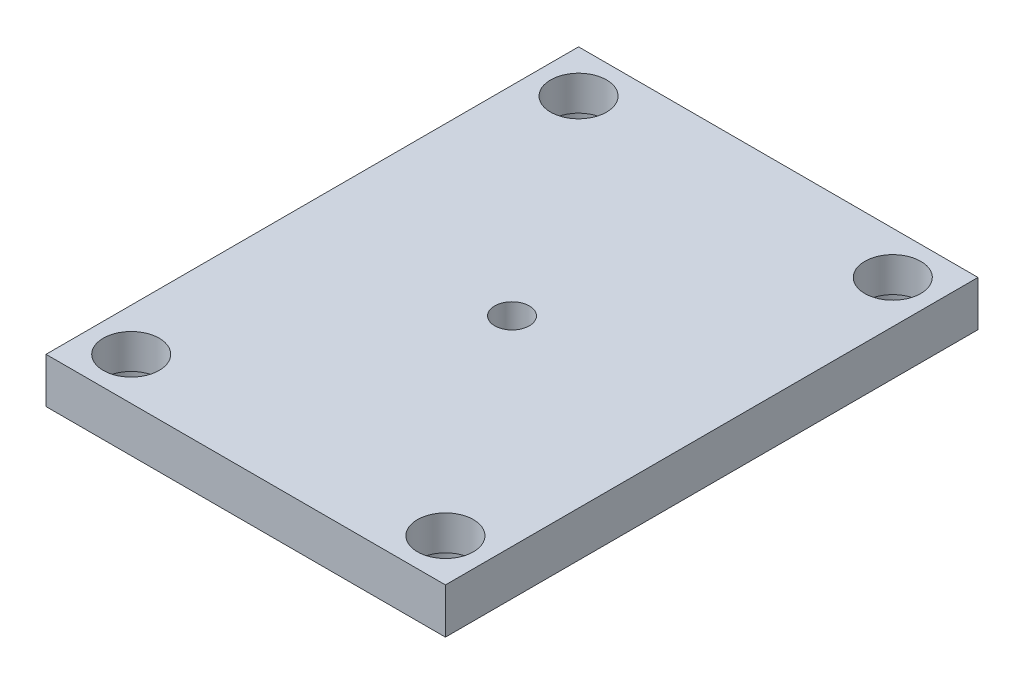
ISO-10303-21;
HEADER;
FILE_DESCRIPTION(('STEP AP214'),'2;1');
FILE_NAME('part.step','',(''),(''),'','','');
FILE_SCHEMA(('AUTOMOTIVE_DESIGN { 1 0 10303 214 1 1 1 1 }'));
ENDSEC;
DATA;
#1=APPLICATION_CONTEXT('core data for automotive mechanical design processes');
#2=APPLICATION_PROTOCOL_DEFINITION('international standard','automotive_design',2000,#1);
#3=PRODUCT_CONTEXT('',#1,'mechanical');
#4=PRODUCT('Part','Part','',(#3));
#5=PRODUCT_RELATED_PRODUCT_CATEGORY('part','',(#4));
#6=PRODUCT_DEFINITION_FORMATION('','',#4);
#7=PRODUCT_DEFINITION_CONTEXT('part definition',#1,'design');
#8=PRODUCT_DEFINITION('design','',#6,#7);
#9=PRODUCT_DEFINITION_SHAPE('','',#8);
#10=(LENGTH_UNIT() NAMED_UNIT(*) SI_UNIT(.MILLI.,.METRE.));
#11=(NAMED_UNIT(*) PLANE_ANGLE_UNIT() SI_UNIT($,.RADIAN.));
#12=(NAMED_UNIT(*) SI_UNIT($,.STERADIAN.) SOLID_ANGLE_UNIT());
#13=UNCERTAINTY_MEASURE_WITH_UNIT(LENGTH_MEASURE(1.E-05),#10,'distance_accuracy_value','');
#14=(GEOMETRIC_REPRESENTATION_CONTEXT(3) GLOBAL_UNCERTAINTY_ASSIGNED_CONTEXT((#13)) GLOBAL_UNIT_ASSIGNED_CONTEXT((#10,
#11,#12)) REPRESENTATION_CONTEXT('',''));
#15=CARTESIAN_POINT('',(0.,0.,0.));
#16=DIRECTION('',(0.,0.,1.));
#17=DIRECTION('',(1.,0.,0.));
#18=AXIS2_PLACEMENT_3D('',#15,#16,#17);
#19=CARTESIAN_POINT('',(-150.,34.,200.));
#20=DIRECTION('',(0.,1.,0.));
#21=DIRECTION('',(0.,0.,1.));
#22=AXIS2_PLACEMENT_3D('',#19,#20,#21);
#23=PLANE('',#22);
#24=CARTESIAN_POINT('',(118.,34.,168.));
#25=DIRECTION('',(0.,-1.,0.));
#26=DIRECTION('',(0.,0.,-1.));
#27=AXIS2_PLACEMENT_3D('',#24,#25,#26);
#28=CIRCLE('',#27,21.);
#29=CARTESIAN_POINT('',(118.,34.,147.));
#30=VERTEX_POINT('',#29);
#31=EDGE_CURVE('E272',#30,#30,#28,.T.);
#32=ORIENTED_EDGE('',*,*,#31,.T.);
#33=EDGE_LOOP('',(#32));
#34=FACE_BOUND('',#33,.T.);
#35=CARTESIAN_POINT('',(118.,34.,-168.));
#36=DIRECTION('',(0.,-1.,0.));
#37=DIRECTION('',(0.,0.,-1.));
#38=AXIS2_PLACEMENT_3D('',#35,#36,#37);
#39=CIRCLE('',#38,21.);
#40=CARTESIAN_POINT('',(118.,34.,-189.));
#41=VERTEX_POINT('',#40);
#42=EDGE_CURVE('E283',#41,#41,#39,.T.);
#43=ORIENTED_EDGE('',*,*,#42,.T.);
#44=EDGE_LOOP('',(#43));
#45=FACE_BOUND('',#44,.T.);
#46=CARTESIAN_POINT('',(-118.,34.,-168.));
#47=DIRECTION('',(0.,-1.,0.));
#48=DIRECTION('',(0.,0.,-1.));
#49=AXIS2_PLACEMENT_3D('',#46,#47,#48);
#50=CIRCLE('',#49,21.);
#51=CARTESIAN_POINT('',(-118.,34.,-189.));
#52=VERTEX_POINT('',#51);
#53=EDGE_CURVE('E295',#52,#52,#50,.T.);
#54=ORIENTED_EDGE('',*,*,#53,.T.);
#55=EDGE_LOOP('',(#54));
#56=FACE_BOUND('',#55,.T.);
#57=CARTESIAN_POINT('',(-118.,34.,168.));
#58=DIRECTION('',(0.,-1.,0.));
#59=DIRECTION('',(0.,0.,-1.));
#60=AXIS2_PLACEMENT_3D('',#57,#58,#59);
#61=CIRCLE('',#60,21.);
#62=CARTESIAN_POINT('',(-118.,34.,147.));
#63=VERTEX_POINT('',#62);
#64=EDGE_CURVE('E104',#63,#63,#61,.T.);
#65=ORIENTED_EDGE('',*,*,#64,.T.);
#66=EDGE_LOOP('',(#65));
#67=FACE_BOUND('',#66,.T.);
#68=DIRECTION('',(0.,0.,1.));
#69=VECTOR('',#68,1.);
#70=CARTESIAN_POINT('',(-150.,34.,-200.));
#71=LINE('',#70,#69);
#72=CARTESIAN_POINT('',(-150.,34.,-200.));
#73=VERTEX_POINT('',#72);
#74=CARTESIAN_POINT('',(-150.,34.,200.));
#75=VERTEX_POINT('',#74);
#76=EDGE_CURVE('E138',#73,#75,#71,.T.);
#77=ORIENTED_EDGE('',*,*,#76,.T.);
#78=DIRECTION('',(1.,0.,0.));
#79=VECTOR('',#78,1.);
#80=CARTESIAN_POINT('',(-150.,34.,200.));
#81=LINE('',#80,#79);
#82=CARTESIAN_POINT('',(150.,34.,200.));
#83=VERTEX_POINT('',#82);
#84=EDGE_CURVE('E80',#75,#83,#81,.T.);
#85=ORIENTED_EDGE('',*,*,#84,.T.);
#86=DIRECTION('',(0.,0.,-1.));
#87=VECTOR('',#86,1.);
#88=CARTESIAN_POINT('',(150.,34.,-200.));
#89=LINE('',#88,#87);
#90=CARTESIAN_POINT('',(150.,34.,-200.));
#91=VERTEX_POINT('',#90);
#92=EDGE_CURVE('E141',#83,#91,#89,.T.);
#93=ORIENTED_EDGE('',*,*,#92,.T.);
#94=DIRECTION('',(-1.,0.,0.));
#95=VECTOR('',#94,1.);
#96=CARTESIAN_POINT('',(-150.,34.,-200.));
#97=LINE('',#96,#95);
#98=EDGE_CURVE('E49',#91,#73,#97,.T.);
#99=ORIENTED_EDGE('',*,*,#98,.T.);
#100=EDGE_LOOP('',(#77,#85,#93,#99));
#101=FACE_BOUND('',#100,.T.);
#102=CARTESIAN_POINT('',(0.,34.,0.));
#103=DIRECTION('',(0.,1.,0.));
#104=DIRECTION('',(0.,0.,1.));
#105=AXIS2_PLACEMENT_3D('',#102,#103,#104);
#106=CIRCLE('',#105,13.);
#107=CARTESIAN_POINT('',(0.,34.,13.));
#108=VERTEX_POINT('',#107);
#109=EDGE_CURVE('E132',#108,#108,#106,.T.);
#110=ORIENTED_EDGE('',*,*,#109,.F.);
#111=EDGE_LOOP('',(#110));
#112=FACE_BOUND('',#111,.T.);
#113=ADVANCED_FACE('F32',(#34,#45,#56,#67,#101,#112),#23,.T.);
#114=CARTESIAN_POINT('',(-150.,0.,200.));
#115=DIRECTION('',(0.,1.,0.));
#116=DIRECTION('',(0.,0.,1.));
#117=AXIS2_PLACEMENT_3D('',#114,#115,#116);
#118=PLANE('',#117);
#119=CARTESIAN_POINT('',(118.,0.,168.));
#120=DIRECTION('',(0.,-1.,0.));
#121=DIRECTION('',(0.,0.,-1.));
#122=AXIS2_PLACEMENT_3D('',#119,#120,#121);
#123=CIRCLE('',#122,24.);
#124=CARTESIAN_POINT('',(118.,0.,144.));
#125=VERTEX_POINT('',#124);
#126=EDGE_CURVE('E265',#125,#125,#123,.T.);
#127=ORIENTED_EDGE('',*,*,#126,.F.);
#128=EDGE_LOOP('',(#127));
#129=FACE_BOUND('',#128,.T.);
#130=CARTESIAN_POINT('',(118.,0.,-168.));
#131=DIRECTION('',(0.,-1.,0.));
#132=DIRECTION('',(0.,0.,-1.));
#133=AXIS2_PLACEMENT_3D('',#130,#131,#132);
#134=CIRCLE('',#133,24.);
#135=CARTESIAN_POINT('',(118.,0.,-192.));
#136=VERTEX_POINT('',#135);
#137=EDGE_CURVE('E274',#136,#136,#134,.T.);
#138=ORIENTED_EDGE('',*,*,#137,.F.);
#139=EDGE_LOOP('',(#138));
#140=FACE_BOUND('',#139,.T.);
#141=CARTESIAN_POINT('',(-118.,0.,-168.));
#142=DIRECTION('',(0.,-1.,0.));
#143=DIRECTION('',(0.,0.,-1.));
#144=AXIS2_PLACEMENT_3D('',#141,#142,#143);
#145=CIRCLE('',#144,24.);
#146=CARTESIAN_POINT('',(-118.,0.,-192.));
#147=VERTEX_POINT('',#146);
#148=EDGE_CURVE('E286',#147,#147,#145,.T.);
#149=ORIENTED_EDGE('',*,*,#148,.F.);
#150=EDGE_LOOP('',(#149));
#151=FACE_BOUND('',#150,.T.);
#152=CARTESIAN_POINT('',(-118.,0.,168.));
#153=DIRECTION('',(0.,-1.,0.));
#154=DIRECTION('',(0.,0.,-1.));
#155=AXIS2_PLACEMENT_3D('',#152,#153,#154);
#156=CIRCLE('',#155,24.);
#157=CARTESIAN_POINT('',(-118.,0.,144.));
#158=VERTEX_POINT('',#157);
#159=EDGE_CURVE('E298',#158,#158,#156,.T.);
#160=ORIENTED_EDGE('',*,*,#159,.F.);
#161=EDGE_LOOP('',(#160));
#162=FACE_BOUND('',#161,.T.);
#163=CARTESIAN_POINT('',(-118.,0.,119.));
#164=DIRECTION('',(0.,-1.,0.));
#165=DIRECTION('',(0.,0.,-1.));
#166=AXIS2_PLACEMENT_3D('',#163,#164,#165);
#167=CIRCLE('',#166,6.99999999999999);
#168=CARTESIAN_POINT('',(-118.,0.,112.));
#169=VERTEX_POINT('',#168);
#170=EDGE_CURVE('E103',#169,#169,#167,.T.);
#171=ORIENTED_EDGE('',*,*,#170,.F.);
#172=EDGE_LOOP('',(#171));
#173=FACE_BOUND('',#172,.T.);
#174=CARTESIAN_POINT('',(118.,0.,119.));
#175=DIRECTION('',(0.,-1.,0.));
#176=DIRECTION('',(0.,0.,-1.));
#177=AXIS2_PLACEMENT_3D('',#174,#175,#176);
#178=CIRCLE('',#177,6.99999999999999);
#179=CARTESIAN_POINT('',(118.,0.,112.));
#180=VERTEX_POINT('',#179);
#181=EDGE_CURVE('E116',#180,#180,#178,.T.);
#182=ORIENTED_EDGE('',*,*,#181,.F.);
#183=EDGE_LOOP('',(#182));
#184=FACE_BOUND('',#183,.T.);
#185=CARTESIAN_POINT('',(-118.,0.,-119.));
#186=DIRECTION('',(0.,-1.,0.));
#187=DIRECTION('',(0.,0.,-1.));
#188=AXIS2_PLACEMENT_3D('',#185,#186,#187);
#189=CIRCLE('',#188,6.99999999999999);
#190=CARTESIAN_POINT('',(-118.,0.,-126.));
#191=VERTEX_POINT('',#190);
#192=EDGE_CURVE('E122',#191,#191,#189,.T.);
#193=ORIENTED_EDGE('',*,*,#192,.F.);
#194=EDGE_LOOP('',(#193));
#195=FACE_BOUND('',#194,.T.);
#196=CARTESIAN_POINT('',(118.,0.,-119.));
#197=DIRECTION('',(0.,-1.,0.));
#198=DIRECTION('',(0.,0.,-1.));
#199=AXIS2_PLACEMENT_3D('',#196,#197,#198);
#200=CIRCLE('',#199,6.99999999999999);
#201=CARTESIAN_POINT('',(118.,0.,-126.));
#202=VERTEX_POINT('',#201);
#203=EDGE_CURVE('E128',#202,#202,#200,.T.);
#204=ORIENTED_EDGE('',*,*,#203,.F.);
#205=EDGE_LOOP('',(#204));
#206=FACE_BOUND('',#205,.T.);
#207=DIRECTION('',(0.,0.,1.));
#208=VECTOR('',#207,1.);
#209=CARTESIAN_POINT('',(-150.,0.,-200.));
#210=LINE('',#209,#208);
#211=CARTESIAN_POINT('',(-150.,0.,-200.));
#212=VERTEX_POINT('',#211);
#213=CARTESIAN_POINT('',(-150.,0.,200.));
#214=VERTEX_POINT('',#213);
#215=EDGE_CURVE('E135',#212,#214,#210,.T.);
#216=ORIENTED_EDGE('',*,*,#215,.F.);
#217=DIRECTION('',(-1.,0.,0.));
#218=VECTOR('',#217,1.);
#219=CARTESIAN_POINT('',(-150.,0.,-200.));
#220=LINE('',#219,#218);
#221=CARTESIAN_POINT('',(150.,0.,-200.));
#222=VERTEX_POINT('',#221);
#223=EDGE_CURVE('E73',#222,#212,#220,.T.);
#224=ORIENTED_EDGE('',*,*,#223,.F.);
#225=DIRECTION('',(0.,0.,-1.));
#226=VECTOR('',#225,1.);
#227=CARTESIAN_POINT('',(150.,0.,-200.));
#228=LINE('',#227,#226);
#229=CARTESIAN_POINT('',(150.,0.,200.));
#230=VERTEX_POINT('',#229);
#231=EDGE_CURVE('E67',#230,#222,#228,.T.);
#232=ORIENTED_EDGE('',*,*,#231,.F.);
#233=DIRECTION('',(1.,0.,0.));
#234=VECTOR('',#233,1.);
#235=CARTESIAN_POINT('',(-150.,0.,200.));
#236=LINE('',#235,#234);
#237=EDGE_CURVE('E147',#214,#230,#236,.T.);
#238=ORIENTED_EDGE('',*,*,#237,.F.);
#239=EDGE_LOOP('',(#216,#224,#232,#238));
#240=FACE_BOUND('',#239,.T.);
#241=CARTESIAN_POINT('',(0.,0.,0.));
#242=DIRECTION('',(0.,1.,0.));
#243=DIRECTION('',(0.,0.,1.));
#244=AXIS2_PLACEMENT_3D('',#241,#242,#243);
#245=CIRCLE('',#244,13.);
#246=CARTESIAN_POINT('',(0.,0.,13.));
#247=VERTEX_POINT('',#246);
#248=EDGE_CURVE('E131',#247,#247,#245,.T.);
#249=ORIENTED_EDGE('',*,*,#248,.T.);
#250=EDGE_LOOP('',(#249));
#251=FACE_BOUND('',#250,.T.);
#252=ADVANCED_FACE('F157',(#129,#140,#151,#162,#173,#184,#195,#206,#240,#251),#118,.F.);
#253=CARTESIAN_POINT('',(-150.,34.,-200.));
#254=DIRECTION('',(1.,0.,0.));
#255=DIRECTION('',(0.,0.,-1.));
#256=AXIS2_PLACEMENT_3D('',#253,#254,#255);
#257=PLANE('',#256);
#258=ORIENTED_EDGE('',*,*,#215,.T.);
#259=DIRECTION('',(0.,-1.,0.));
#260=VECTOR('',#259,1.);
#261=CARTESIAN_POINT('',(-150.,34.,200.));
#262=LINE('',#261,#260);
#263=EDGE_CURVE('E11',#75,#214,#262,.T.);
#264=ORIENTED_EDGE('',*,*,#263,.F.);
#265=ORIENTED_EDGE('',*,*,#76,.F.);
#266=DIRECTION('',(0.,-1.,0.));
#267=VECTOR('',#266,1.);
#268=CARTESIAN_POINT('',(-150.,34.,-200.));
#269=LINE('',#268,#267);
#270=EDGE_CURVE('E144',#73,#212,#269,.T.);
#271=ORIENTED_EDGE('',*,*,#270,.T.);
#272=EDGE_LOOP('',(#258,#264,#265,#271));
#273=FACE_BOUND('',#272,.T.);
#274=ADVANCED_FACE('F34',(#273),#257,.F.);
#275=CARTESIAN_POINT('',(-150.,34.,200.));
#276=DIRECTION('',(0.,0.,-1.));
#277=DIRECTION('',(-1.,0.,0.));
#278=AXIS2_PLACEMENT_3D('',#275,#276,#277);
#279=PLANE('',#278);
#280=ORIENTED_EDGE('',*,*,#237,.T.);
#281=DIRECTION('',(0.,-1.,0.));
#282=VECTOR('',#281,1.);
#283=CARTESIAN_POINT('',(150.,34.,200.));
#284=LINE('',#283,#282);
#285=EDGE_CURVE('E41',#83,#230,#284,.T.);
#286=ORIENTED_EDGE('',*,*,#285,.F.);
#287=ORIENTED_EDGE('',*,*,#84,.F.);
#288=ORIENTED_EDGE('',*,*,#263,.T.);
#289=EDGE_LOOP('',(#280,#286,#287,#288));
#290=FACE_BOUND('',#289,.T.);
#291=ADVANCED_FACE('F173',(#290),#279,.F.);
#292=CARTESIAN_POINT('',(150.,34.,-200.));
#293=DIRECTION('',(-1.,0.,0.));
#294=DIRECTION('',(0.,0.,1.));
#295=AXIS2_PLACEMENT_3D('',#292,#293,#294);
#296=PLANE('',#295);
#297=ORIENTED_EDGE('',*,*,#231,.T.);
#298=DIRECTION('',(0.,-1.,0.));
#299=VECTOR('',#298,1.);
#300=CARTESIAN_POINT('',(150.,34.,-200.));
#301=LINE('',#300,#299);
#302=EDGE_CURVE('E152',#91,#222,#301,.T.);
#303=ORIENTED_EDGE('',*,*,#302,.F.);
#304=ORIENTED_EDGE('',*,*,#92,.F.);
#305=ORIENTED_EDGE('',*,*,#285,.T.);
#306=EDGE_LOOP('',(#297,#303,#304,#305));
#307=FACE_BOUND('',#306,.T.);
#308=ADVANCED_FACE('F154',(#307),#296,.F.);
#309=CARTESIAN_POINT('',(-150.,34.,-200.));
#310=DIRECTION('',(0.,0.,1.));
#311=DIRECTION('',(1.,0.,0.));
#312=AXIS2_PLACEMENT_3D('',#309,#310,#311);
#313=PLANE('',#312);
#314=ORIENTED_EDGE('',*,*,#223,.T.);
#315=ORIENTED_EDGE('',*,*,#270,.F.);
#316=ORIENTED_EDGE('',*,*,#98,.F.);
#317=ORIENTED_EDGE('',*,*,#302,.T.);
#318=EDGE_LOOP('',(#314,#315,#316,#317));
#319=FACE_BOUND('',#318,.T.);
#320=ADVANCED_FACE('F162',(#319),#313,.F.);
#321=CARTESIAN_POINT('',(0.,34.,0.));
#322=DIRECTION('',(0.,-1.,0.));
#323=DIRECTION('',(0.,0.,-1.));
#324=AXIS2_PLACEMENT_3D('',#321,#322,#323);
#325=CYLINDRICAL_SURFACE('',#324,13.);
#326=ORIENTED_EDGE('',*,*,#109,.T.);
#327=EDGE_LOOP('',(#326));
#328=FACE_BOUND('',#327,.T.);
#329=ORIENTED_EDGE('',*,*,#248,.F.);
#330=EDGE_LOOP('',(#329));
#331=FACE_BOUND('',#330,.T.);
#332=ADVANCED_FACE('F164',(#328,#331),#325,.F.);
#333=CARTESIAN_POINT('',(118.,0.,-119.));
#334=DIRECTION('',(0.,-1.,0.));
#335=DIRECTION('',(0.,0.,-1.));
#336=AXIS2_PLACEMENT_3D('',#333,#334,#335);
#337=CYLINDRICAL_SURFACE('',#336,6.99999999999999);
#338=CARTESIAN_POINT('',(118.,28.,-119.));
#339=DIRECTION('',(0.,-1.,0.));
#340=DIRECTION('',(0.,0.,-1.));
#341=AXIS2_PLACEMENT_3D('',#338,#339,#340);
#342=CIRCLE('',#341,6.99999999999999);
#343=CARTESIAN_POINT('',(118.,28.,-126.));
#344=VERTEX_POINT('',#343);
#345=EDGE_CURVE('E125',#344,#344,#342,.T.);
#346=ORIENTED_EDGE('',*,*,#345,.F.);
#347=EDGE_LOOP('',(#346));
#348=FACE_BOUND('',#347,.T.);
#349=ORIENTED_EDGE('',*,*,#203,.T.);
#350=EDGE_LOOP('',(#349));
#351=FACE_BOUND('',#350,.T.);
#352=ADVANCED_FACE('F170',(#348,#351),#337,.F.);
#353=CARTESIAN_POINT('',(118.,28.,-119.));
#354=DIRECTION('',(0.,-1.,0.));
#355=DIRECTION('',(0.,0.,-1.));
#356=AXIS2_PLACEMENT_3D('',#353,#354,#355);
#357=CONICAL_SURFACE('',#356,6.99999999999999,1.02974425867665);
#358=CARTESIAN_POINT('',(118.,32.2060243331929,-119.));
#359=VERTEX_POINT('',#358);
#360=VERTEX_LOOP('',#359);
#361=FACE_BOUND('',#360,.T.);
#362=ORIENTED_EDGE('',*,*,#345,.T.);
#363=EDGE_LOOP('',(#362));
#364=FACE_BOUND('',#363,.T.);
#365=ADVANCED_FACE('F188',(#361,#364),#357,.F.);
#366=CARTESIAN_POINT('',(-118.,0.,-119.));
#367=DIRECTION('',(0.,-1.,0.));
#368=DIRECTION('',(0.,0.,-1.));
#369=AXIS2_PLACEMENT_3D('',#366,#367,#368);
#370=CYLINDRICAL_SURFACE('',#369,6.99999999999999);
#371=CARTESIAN_POINT('',(-118.,28.,-119.));
#372=DIRECTION('',(0.,-1.,0.));
#373=DIRECTION('',(0.,0.,-1.));
#374=AXIS2_PLACEMENT_3D('',#371,#372,#373);
#375=CIRCLE('',#374,6.99999999999999);
#376=CARTESIAN_POINT('',(-118.,28.,-126.));
#377=VERTEX_POINT('',#376);
#378=EDGE_CURVE('E119',#377,#377,#375,.T.);
#379=ORIENTED_EDGE('',*,*,#378,.F.);
#380=EDGE_LOOP('',(#379));
#381=FACE_BOUND('',#380,.T.);
#382=ORIENTED_EDGE('',*,*,#192,.T.);
#383=EDGE_LOOP('',(#382));
#384=FACE_BOUND('',#383,.T.);
#385=ADVANCED_FACE('F192',(#381,#384),#370,.F.);
#386=CARTESIAN_POINT('',(-118.,28.,-119.));
#387=DIRECTION('',(0.,-1.,0.));
#388=DIRECTION('',(0.,0.,-1.));
#389=AXIS2_PLACEMENT_3D('',#386,#387,#388);
#390=CONICAL_SURFACE('',#389,6.99999999999999,1.02974425867665);
#391=CARTESIAN_POINT('',(-118.,32.2060243331929,-119.));
#392=VERTEX_POINT('',#391);
#393=VERTEX_LOOP('',#392);
#394=FACE_BOUND('',#393,.T.);
#395=ORIENTED_EDGE('',*,*,#378,.T.);
#396=EDGE_LOOP('',(#395));
#397=FACE_BOUND('',#396,.T.);
#398=ADVANCED_FACE('F196',(#394,#397),#390,.F.);
#399=CARTESIAN_POINT('',(118.,0.,119.));
#400=DIRECTION('',(0.,-1.,0.));
#401=DIRECTION('',(0.,0.,-1.));
#402=AXIS2_PLACEMENT_3D('',#399,#400,#401);
#403=CYLINDRICAL_SURFACE('',#402,6.99999999999999);
#404=CARTESIAN_POINT('',(118.,28.,119.));
#405=DIRECTION('',(0.,-1.,0.));
#406=DIRECTION('',(0.,0.,-1.));
#407=AXIS2_PLACEMENT_3D('',#404,#405,#406);
#408=CIRCLE('',#407,6.99999999999999);
#409=CARTESIAN_POINT('',(118.,28.,112.));
#410=VERTEX_POINT('',#409);
#411=EDGE_CURVE('E107',#410,#410,#408,.T.);
#412=ORIENTED_EDGE('',*,*,#411,.F.);
#413=EDGE_LOOP('',(#412));
#414=FACE_BOUND('',#413,.T.);
#415=ORIENTED_EDGE('',*,*,#181,.T.);
#416=EDGE_LOOP('',(#415));
#417=FACE_BOUND('',#416,.T.);
#418=ADVANCED_FACE('F200',(#414,#417),#403,.F.);
#419=CARTESIAN_POINT('',(118.,28.,119.));
#420=DIRECTION('',(0.,-1.,0.));
#421=DIRECTION('',(0.,0.,-1.));
#422=AXIS2_PLACEMENT_3D('',#419,#420,#421);
#423=CONICAL_SURFACE('',#422,6.99999999999999,1.02974425867665);
#424=CARTESIAN_POINT('',(118.,32.2060243331929,119.));
#425=VERTEX_POINT('',#424);
#426=VERTEX_LOOP('',#425);
#427=FACE_BOUND('',#426,.T.);
#428=ORIENTED_EDGE('',*,*,#411,.T.);
#429=EDGE_LOOP('',(#428));
#430=FACE_BOUND('',#429,.T.);
#431=ADVANCED_FACE('F204',(#427,#430),#423,.F.);
#432=CARTESIAN_POINT('',(-118.,0.,119.));
#433=DIRECTION('',(0.,-1.,0.));
#434=DIRECTION('',(0.,0.,-1.));
#435=AXIS2_PLACEMENT_3D('',#432,#433,#434);
#436=CYLINDRICAL_SURFACE('',#435,6.99999999999999);
#437=CARTESIAN_POINT('',(-118.,28.,119.));
#438=DIRECTION('',(0.,-1.,0.));
#439=DIRECTION('',(0.,0.,-1.));
#440=AXIS2_PLACEMENT_3D('',#437,#438,#439);
#441=CIRCLE('',#440,6.99999999999999);
#442=CARTESIAN_POINT('',(-118.,28.,112.));
#443=VERTEX_POINT('',#442);
#444=EDGE_CURVE('E101',#443,#443,#441,.T.);
#445=ORIENTED_EDGE('',*,*,#444,.F.);
#446=EDGE_LOOP('',(#445));
#447=FACE_BOUND('',#446,.T.);
#448=ORIENTED_EDGE('',*,*,#170,.T.);
#449=EDGE_LOOP('',(#448));
#450=FACE_BOUND('',#449,.T.);
#451=ADVANCED_FACE('F97',(#447,#450),#436,.F.);
#452=CARTESIAN_POINT('',(-118.,28.,119.));
#453=DIRECTION('',(0.,-1.,0.));
#454=DIRECTION('',(0.,0.,-1.));
#455=AXIS2_PLACEMENT_3D('',#452,#453,#454);
#456=CONICAL_SURFACE('',#455,6.99999999999999,1.02974425867665);
#457=CARTESIAN_POINT('',(-118.,32.2060243331929,119.));
#458=VERTEX_POINT('',#457);
#459=VERTEX_LOOP('',#458);
#460=FACE_BOUND('',#459,.T.);
#461=ORIENTED_EDGE('',*,*,#444,.T.);
#462=EDGE_LOOP('',(#461));
#463=FACE_BOUND('',#462,.T.);
#464=ADVANCED_FACE('F93',(#460,#463),#456,.F.);
#465=CARTESIAN_POINT('',(-118.,0.,168.));
#466=DIRECTION('',(0.,-1.,0.));
#467=DIRECTION('',(0.,0.,-1.));
#468=AXIS2_PLACEMENT_3D('',#465,#466,#467);
#469=CYLINDRICAL_SURFACE('',#468,21.);
#470=ORIENTED_EDGE('',*,*,#64,.F.);
#471=EDGE_LOOP('',(#470));
#472=FACE_BOUND('',#471,.T.);
#473=CARTESIAN_POINT('',(-118.,8.,168.));
#474=DIRECTION('',(0.,-1.,0.));
#475=DIRECTION('',(0.,0.,-1.));
#476=AXIS2_PLACEMENT_3D('',#473,#474,#475);
#477=CIRCLE('',#476,21.);
#478=CARTESIAN_POINT('',(-118.,8.,147.));
#479=VERTEX_POINT('',#478);
#480=EDGE_CURVE('E110',#479,#479,#477,.T.);
#481=ORIENTED_EDGE('',*,*,#480,.T.);
#482=EDGE_LOOP('',(#481));
#483=FACE_BOUND('',#482,.T.);
#484=ADVANCED_FACE('F96',(#472,#483),#469,.F.);
#485=CARTESIAN_POINT('',(-97.,8.,168.));
#486=DIRECTION('',(0.,1.,0.));
#487=DIRECTION('',(0.,0.,1.));
#488=AXIS2_PLACEMENT_3D('',#485,#486,#487);
#489=PLANE('',#488);
#490=ORIENTED_EDGE('',*,*,#480,.F.);
#491=EDGE_LOOP('',(#490));
#492=FACE_BOUND('',#491,.T.);
#493=CARTESIAN_POINT('',(-118.,8.,168.));
#494=DIRECTION('',(0.,-1.,0.));
#495=DIRECTION('',(0.,0.,-1.));
#496=AXIS2_PLACEMENT_3D('',#493,#494,#495);
#497=CIRCLE('',#496,24.);
#498=CARTESIAN_POINT('',(-118.,8.,144.));
#499=VERTEX_POINT('',#498);
#500=EDGE_CURVE('E301',#499,#499,#497,.T.);
#501=ORIENTED_EDGE('',*,*,#500,.T.);
#502=EDGE_LOOP('',(#501));
#503=FACE_BOUND('',#502,.T.);
#504=ADVANCED_FACE('F213',(#492,#503),#489,.F.);
#505=CARTESIAN_POINT('',(-118.,0.,168.));
#506=DIRECTION('',(0.,-1.,0.));
#507=DIRECTION('',(0.,0.,-1.));
#508=AXIS2_PLACEMENT_3D('',#505,#506,#507);
#509=CYLINDRICAL_SURFACE('',#508,24.);
#510=ORIENTED_EDGE('',*,*,#500,.F.);
#511=EDGE_LOOP('',(#510));
#512=FACE_BOUND('',#511,.T.);
#513=ORIENTED_EDGE('',*,*,#159,.T.);
#514=EDGE_LOOP('',(#513));
#515=FACE_BOUND('',#514,.T.);
#516=ADVANCED_FACE('F217',(#512,#515),#509,.F.);
#517=CARTESIAN_POINT('',(-118.,0.,-168.));
#518=DIRECTION('',(0.,-1.,0.));
#519=DIRECTION('',(0.,0.,-1.));
#520=AXIS2_PLACEMENT_3D('',#517,#518,#519);
#521=CYLINDRICAL_SURFACE('',#520,21.);
#522=ORIENTED_EDGE('',*,*,#53,.F.);
#523=EDGE_LOOP('',(#522));
#524=FACE_BOUND('',#523,.T.);
#525=CARTESIAN_POINT('',(-118.,8.,-168.));
#526=DIRECTION('',(0.,-1.,0.));
#527=DIRECTION('',(0.,0.,-1.));
#528=AXIS2_PLACEMENT_3D('',#525,#526,#527);
#529=CIRCLE('',#528,21.);
#530=CARTESIAN_POINT('',(-118.,8.,-189.));
#531=VERTEX_POINT('',#530);
#532=EDGE_CURVE('E292',#531,#531,#529,.T.);
#533=ORIENTED_EDGE('',*,*,#532,.T.);
#534=EDGE_LOOP('',(#533));
#535=FACE_BOUND('',#534,.T.);
#536=ADVANCED_FACE('F221',(#524,#535),#521,.F.);
#537=CARTESIAN_POINT('',(-97.,8.,-168.));
#538=DIRECTION('',(0.,1.,0.));
#539=DIRECTION('',(0.,0.,1.));
#540=AXIS2_PLACEMENT_3D('',#537,#538,#539);
#541=PLANE('',#540);
#542=ORIENTED_EDGE('',*,*,#532,.F.);
#543=EDGE_LOOP('',(#542));
#544=FACE_BOUND('',#543,.T.);
#545=CARTESIAN_POINT('',(-118.,8.,-168.));
#546=DIRECTION('',(0.,-1.,0.));
#547=DIRECTION('',(0.,0.,-1.));
#548=AXIS2_PLACEMENT_3D('',#545,#546,#547);
#549=CIRCLE('',#548,24.);
#550=CARTESIAN_POINT('',(-118.,8.,-192.));
#551=VERTEX_POINT('',#550);
#552=EDGE_CURVE('E289',#551,#551,#549,.T.);
#553=ORIENTED_EDGE('',*,*,#552,.T.);
#554=EDGE_LOOP('',(#553));
#555=FACE_BOUND('',#554,.T.);
#556=ADVANCED_FACE('F225',(#544,#555),#541,.F.);
#557=CARTESIAN_POINT('',(-118.,0.,-168.));
#558=DIRECTION('',(0.,-1.,0.));
#559=DIRECTION('',(0.,0.,-1.));
#560=AXIS2_PLACEMENT_3D('',#557,#558,#559);
#561=CYLINDRICAL_SURFACE('',#560,24.);
#562=ORIENTED_EDGE('',*,*,#552,.F.);
#563=EDGE_LOOP('',(#562));
#564=FACE_BOUND('',#563,.T.);
#565=ORIENTED_EDGE('',*,*,#148,.T.);
#566=EDGE_LOOP('',(#565));
#567=FACE_BOUND('',#566,.T.);
#568=ADVANCED_FACE('F229',(#564,#567),#561,.F.);
#569=CARTESIAN_POINT('',(118.,0.,-168.));
#570=DIRECTION('',(0.,-1.,0.));
#571=DIRECTION('',(0.,0.,-1.));
#572=AXIS2_PLACEMENT_3D('',#569,#570,#571);
#573=CYLINDRICAL_SURFACE('',#572,21.);
#574=ORIENTED_EDGE('',*,*,#42,.F.);
#575=EDGE_LOOP('',(#574));
#576=FACE_BOUND('',#575,.T.);
#577=CARTESIAN_POINT('',(118.,8.,-168.));
#578=DIRECTION('',(0.,-1.,0.));
#579=DIRECTION('',(0.,0.,-1.));
#580=AXIS2_PLACEMENT_3D('',#577,#578,#579);
#581=CIRCLE('',#580,21.);
#582=CARTESIAN_POINT('',(118.,8.,-189.));
#583=VERTEX_POINT('',#582);
#584=EDGE_CURVE('E280',#583,#583,#581,.T.);
#585=ORIENTED_EDGE('',*,*,#584,.T.);
#586=EDGE_LOOP('',(#585));
#587=FACE_BOUND('',#586,.T.);
#588=ADVANCED_FACE('F233',(#576,#587),#573,.F.);
#589=CARTESIAN_POINT('',(139.,8.,-168.));
#590=DIRECTION('',(0.,1.,0.));
#591=DIRECTION('',(0.,0.,1.));
#592=AXIS2_PLACEMENT_3D('',#589,#590,#591);
#593=PLANE('',#592);
#594=ORIENTED_EDGE('',*,*,#584,.F.);
#595=EDGE_LOOP('',(#594));
#596=FACE_BOUND('',#595,.T.);
#597=CARTESIAN_POINT('',(118.,8.,-168.));
#598=DIRECTION('',(0.,-1.,0.));
#599=DIRECTION('',(0.,0.,-1.));
#600=AXIS2_PLACEMENT_3D('',#597,#598,#599);
#601=CIRCLE('',#600,24.);
#602=CARTESIAN_POINT('',(118.,8.,-192.));
#603=VERTEX_POINT('',#602);
#604=EDGE_CURVE('E277',#603,#603,#601,.T.);
#605=ORIENTED_EDGE('',*,*,#604,.T.);
#606=EDGE_LOOP('',(#605));
#607=FACE_BOUND('',#606,.T.);
#608=ADVANCED_FACE('F237',(#596,#607),#593,.F.);
#609=CARTESIAN_POINT('',(118.,0.,-168.));
#610=DIRECTION('',(0.,-1.,0.));
#611=DIRECTION('',(0.,0.,-1.));
#612=AXIS2_PLACEMENT_3D('',#609,#610,#611);
#613=CYLINDRICAL_SURFACE('',#612,24.);
#614=ORIENTED_EDGE('',*,*,#604,.F.);
#615=EDGE_LOOP('',(#614));
#616=FACE_BOUND('',#615,.T.);
#617=ORIENTED_EDGE('',*,*,#137,.T.);
#618=EDGE_LOOP('',(#617));
#619=FACE_BOUND('',#618,.T.);
#620=ADVANCED_FACE('F241',(#616,#619),#613,.F.);
#621=CARTESIAN_POINT('',(118.,0.,168.));
#622=DIRECTION('',(0.,-1.,0.));
#623=DIRECTION('',(0.,0.,-1.));
#624=AXIS2_PLACEMENT_3D('',#621,#622,#623);
#625=CYLINDRICAL_SURFACE('',#624,21.);
#626=ORIENTED_EDGE('',*,*,#31,.F.);
#627=EDGE_LOOP('',(#626));
#628=FACE_BOUND('',#627,.T.);
#629=CARTESIAN_POINT('',(118.,8.,168.));
#630=DIRECTION('',(0.,-1.,0.));
#631=DIRECTION('',(0.,0.,-1.));
#632=AXIS2_PLACEMENT_3D('',#629,#630,#631);
#633=CIRCLE('',#632,21.);
#634=CARTESIAN_POINT('',(118.,8.,147.));
#635=VERTEX_POINT('',#634);
#636=EDGE_CURVE('E267',#635,#635,#633,.T.);
#637=ORIENTED_EDGE('',*,*,#636,.T.);
#638=EDGE_LOOP('',(#637));
#639=FACE_BOUND('',#638,.T.);
#640=ADVANCED_FACE('F245',(#628,#639),#625,.F.);
#641=CARTESIAN_POINT('',(139.,8.,168.));
#642=DIRECTION('',(0.,1.,0.));
#643=DIRECTION('',(0.,0.,1.));
#644=AXIS2_PLACEMENT_3D('',#641,#642,#643);
#645=PLANE('',#644);
#646=ORIENTED_EDGE('',*,*,#636,.F.);
#647=EDGE_LOOP('',(#646));
#648=FACE_BOUND('',#647,.T.);
#649=CARTESIAN_POINT('',(118.,8.,168.));
#650=DIRECTION('',(0.,-1.,0.));
#651=DIRECTION('',(0.,0.,-1.));
#652=AXIS2_PLACEMENT_3D('',#649,#650,#651);
#653=CIRCLE('',#652,24.);
#654=CARTESIAN_POINT('',(118.,8.,144.));
#655=VERTEX_POINT('',#654);
#656=EDGE_CURVE('E262',#655,#655,#653,.T.);
#657=ORIENTED_EDGE('',*,*,#656,.T.);
#658=EDGE_LOOP('',(#657));
#659=FACE_BOUND('',#658,.T.);
#660=ADVANCED_FACE('F249',(#648,#659),#645,.F.);
#661=CARTESIAN_POINT('',(118.,0.,168.));
#662=DIRECTION('',(0.,-1.,0.));
#663=DIRECTION('',(0.,0.,-1.));
#664=AXIS2_PLACEMENT_3D('',#661,#662,#663);
#665=CYLINDRICAL_SURFACE('',#664,24.);
#666=ORIENTED_EDGE('',*,*,#656,.F.);
#667=EDGE_LOOP('',(#666));
#668=FACE_BOUND('',#667,.T.);
#669=ORIENTED_EDGE('',*,*,#126,.T.);
#670=EDGE_LOOP('',(#669));
#671=FACE_BOUND('',#670,.T.);
#672=ADVANCED_FACE('F253',(#668,#671),#665,.F.);
#673=CLOSED_SHELL('',(#113,#252,#274,#291,#308,#320,#332,#352,#365,#385,#398,#418,#431,#451,
#464,#484,#504,#516,#536,#556,#568,#588,#608,#620,#640,#660,#672));
#674=MANIFOLD_SOLID_BREP('B2',#673);
#675=ADVANCED_BREP_SHAPE_REPRESENTATION('',(#18,#674),#14);
#676=SHAPE_DEFINITION_REPRESENTATION(#9,#675);
ENDSEC;
END-ISO-10303-21;
